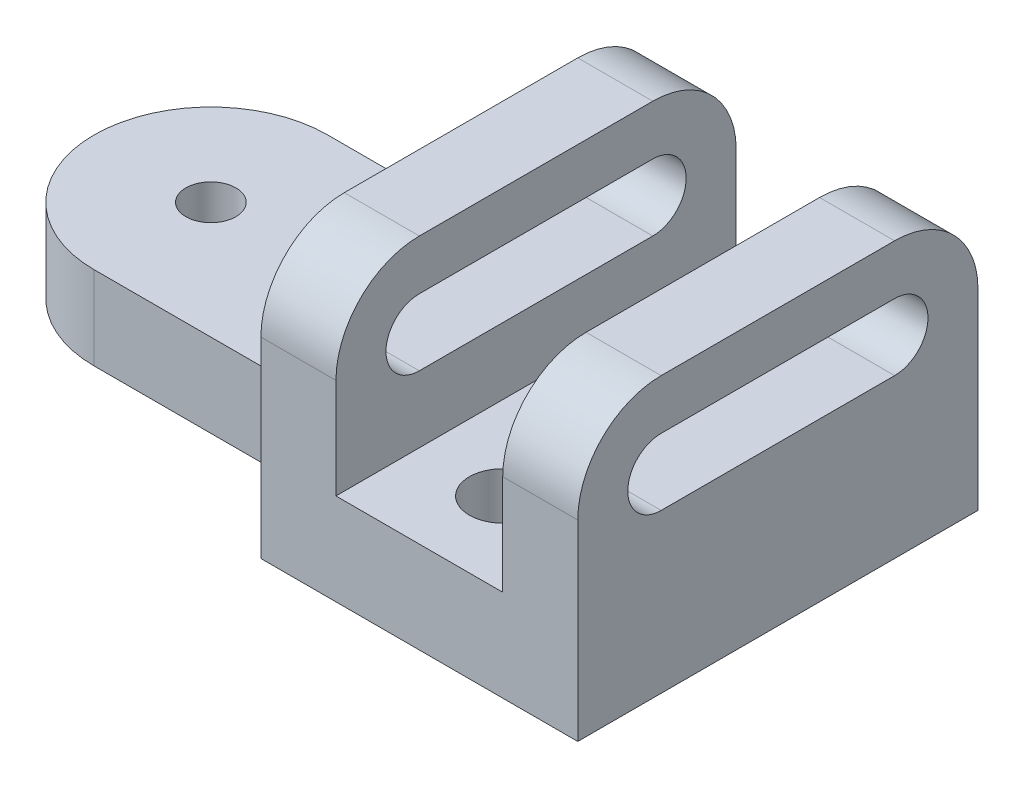
ISO-10303-21;
HEADER;
FILE_DESCRIPTION(('STEP AP214'),'2;1');
FILE_NAME('part.step','',(''),(''),'','','');
FILE_SCHEMA(('AUTOMOTIVE_DESIGN { 1 0 10303 214 1 1 1 1 }'));
ENDSEC;
DATA;
#1=APPLICATION_CONTEXT('core data for automotive mechanical design processes');
#2=APPLICATION_PROTOCOL_DEFINITION('international standard','automotive_design',2000,#1);
#3=PRODUCT_CONTEXT('',#1,'mechanical');
#4=PRODUCT('Part','Part','',(#3));
#5=PRODUCT_RELATED_PRODUCT_CATEGORY('part','',(#4));
#6=PRODUCT_DEFINITION_FORMATION('','',#4);
#7=PRODUCT_DEFINITION_CONTEXT('part definition',#1,'design');
#8=PRODUCT_DEFINITION('design','',#6,#7);
#9=PRODUCT_DEFINITION_SHAPE('','',#8);
#10=(LENGTH_UNIT() NAMED_UNIT(*) SI_UNIT(.MILLI.,.METRE.));
#11=(NAMED_UNIT(*) PLANE_ANGLE_UNIT() SI_UNIT($,.RADIAN.));
#12=(NAMED_UNIT(*) SI_UNIT($,.STERADIAN.) SOLID_ANGLE_UNIT());
#13=UNCERTAINTY_MEASURE_WITH_UNIT(LENGTH_MEASURE(1.E-05),#10,'distance_accuracy_value','');
#14=(GEOMETRIC_REPRESENTATION_CONTEXT(3) GLOBAL_UNCERTAINTY_ASSIGNED_CONTEXT((#13)) GLOBAL_UNIT_ASSIGNED_CONTEXT((#10,
#11,#12)) REPRESENTATION_CONTEXT('',''));
#15=CARTESIAN_POINT('',(0.,0.,0.));
#16=DIRECTION('',(0.,0.,1.));
#17=DIRECTION('',(1.,0.,0.));
#18=AXIS2_PLACEMENT_3D('',#15,#16,#17);
#19=CARTESIAN_POINT('',(0.,36.5125,60.325));
#20=DIRECTION('',(1.,0.,0.));
#21=DIRECTION('',(0.,0.,-1.));
#22=AXIS2_PLACEMENT_3D('',#19,#20,#21);
#23=PLANE('',#22);
#24=CARTESIAN_POINT('',(0.,36.5125,60.325));
#25=DIRECTION('',(1.,0.,0.));
#26=DIRECTION('',(0.,0.,-1.));
#27=AXIS2_PLACEMENT_3D('',#24,#25,#26);
#28=CIRCLE('',#27,6.35);
#29=CARTESIAN_POINT('',(0.,42.8625,60.325));
#30=VERTEX_POINT('',#29);
#31=CARTESIAN_POINT('',(0.,30.1625,60.325));
#32=VERTEX_POINT('',#31);
#33=EDGE_CURVE('E311',#30,#32,#28,.T.);
#34=ORIENTED_EDGE('',*,*,#33,.T.);
#35=DIRECTION('',(0.,0.,-1.));
#36=VECTOR('',#35,1.);
#37=CARTESIAN_POINT('',(0.,30.1625,60.325));
#38=LINE('',#37,#36);
#39=CARTESIAN_POINT('',(0.,30.1625,15.875));
#40=VERTEX_POINT('',#39);
#41=EDGE_CURVE('E325',#32,#40,#38,.T.);
#42=ORIENTED_EDGE('',*,*,#41,.T.);
#43=CARTESIAN_POINT('',(0.,36.5125,15.875));
#44=DIRECTION('',(1.,0.,0.));
#45=DIRECTION('',(0.,0.,1.));
#46=AXIS2_PLACEMENT_3D('',#43,#44,#45);
#47=CIRCLE('',#46,6.35);
#48=CARTESIAN_POINT('',(0.,42.8625,15.875));
#49=VERTEX_POINT('',#48);
#50=EDGE_CURVE('E328',#40,#49,#47,.T.);
#51=ORIENTED_EDGE('',*,*,#50,.T.);
#52=DIRECTION('',(0.,0.,1.));
#53=VECTOR('',#52,1.);
#54=CARTESIAN_POINT('',(0.,42.8625,60.325));
#55=LINE('',#54,#53);
#56=EDGE_CURVE('E315',#49,#30,#55,.T.);
#57=ORIENTED_EDGE('',*,*,#56,.T.);
#58=EDGE_LOOP('',(#34,#42,#51,#57));
#59=FACE_BOUND('',#58,.T.);
#60=DIRECTION('',(0.,0.,-1.));
#61=VECTOR('',#60,1.);
#62=CARTESIAN_POINT('',(0.,0.,76.2));
#63=LINE('',#62,#61);
#64=CARTESIAN_POINT('',(0.,0.,3.175));
#65=VERTEX_POINT('',#64);
#66=CARTESIAN_POINT('',(0.,0.,0.));
#67=VERTEX_POINT('',#66);
#68=EDGE_CURVE('E368',#65,#67,#63,.T.);
#69=ORIENTED_EDGE('',*,*,#68,.F.);
#70=DIRECTION('',(0.,-1.,0.));
#71=VECTOR('',#70,1.);
#72=CARTESIAN_POINT('',(0.,15.875,3.17499999999999));
#73=LINE('',#72,#71);
#74=CARTESIAN_POINT('',(0.,15.875,3.17499999999999));
#75=VERTEX_POINT('',#74);
#76=EDGE_CURVE('E390',#65,#75,#73,.F.);
#77=ORIENTED_EDGE('',*,*,#76,.T.);
#78=DIRECTION('',(0.,0.,-1.));
#79=VECTOR('',#78,1.);
#80=CARTESIAN_POINT('',(0.,15.875,0.));
#81=LINE('',#80,#79);
#82=CARTESIAN_POINT('',(0.,15.875,73.025));
#83=VERTEX_POINT('',#82);
#84=EDGE_CURVE('E227',#83,#75,#81,.T.);
#85=ORIENTED_EDGE('',*,*,#84,.F.);
#86=DIRECTION('',(0.,-1.,0.));
#87=VECTOR('',#86,1.);
#88=CARTESIAN_POINT('',(0.,36.5125,73.025));
#89=LINE('',#88,#87);
#90=CARTESIAN_POINT('',(0.,0.,73.025));
#91=VERTEX_POINT('',#90);
#92=EDGE_CURVE('E407',#83,#91,#89,.T.);
#93=ORIENTED_EDGE('',*,*,#92,.T.);
#94=CARTESIAN_POINT('',(0.,0.,76.2));
#95=VERTEX_POINT('',#94);
#96=EDGE_CURVE('E378',#95,#91,#63,.T.);
#97=ORIENTED_EDGE('',*,*,#96,.F.);
#98=DIRECTION('',(0.,-1.,0.));
#99=VECTOR('',#98,1.);
#100=CARTESIAN_POINT('',(0.,36.5125,76.2));
#101=LINE('',#100,#99);
#102=CARTESIAN_POINT('',(0.,36.5125,76.2));
#103=VERTEX_POINT('',#102);
#104=EDGE_CURVE('E366',#103,#95,#101,.T.);
#105=ORIENTED_EDGE('',*,*,#104,.F.);
#106=CARTESIAN_POINT('',(0.,36.5125,60.325));
#107=DIRECTION('',(1.,0.,0.));
#108=DIRECTION('',(0.,0.,-1.));
#109=AXIS2_PLACEMENT_3D('',#106,#107,#108);
#110=CIRCLE('',#109,15.875);
#111=CARTESIAN_POINT('',(0.,52.3875,60.325));
#112=VERTEX_POINT('',#111);
#113=EDGE_CURVE('E348',#112,#103,#110,.T.);
#114=ORIENTED_EDGE('',*,*,#113,.F.);
#115=DIRECTION('',(0.,0.,1.));
#116=VECTOR('',#115,1.);
#117=CARTESIAN_POINT('',(0.,52.3875,60.325));
#118=LINE('',#117,#116);
#119=CARTESIAN_POINT('',(0.,52.3875,15.875));
#120=VERTEX_POINT('',#119);
#121=EDGE_CURVE('E353',#120,#112,#118,.T.);
#122=ORIENTED_EDGE('',*,*,#121,.F.);
#123=CARTESIAN_POINT('',(0.,36.5125,15.875));
#124=DIRECTION('',(1.,0.,0.));
#125=DIRECTION('',(0.,0.,1.));
#126=AXIS2_PLACEMENT_3D('',#123,#124,#125);
#127=CIRCLE('',#126,15.875);
#128=CARTESIAN_POINT('',(0.,36.5125,0.));
#129=VERTEX_POINT('',#128);
#130=EDGE_CURVE('E441',#129,#120,#127,.T.);
#131=ORIENTED_EDGE('',*,*,#130,.F.);
#132=DIRECTION('',(0.,1.,0.));
#133=VECTOR('',#132,1.);
#134=CARTESIAN_POINT('',(0.,36.5125,0.));
#135=LINE('',#134,#133);
#136=EDGE_CURVE('E371',#67,#129,#135,.T.);
#137=ORIENTED_EDGE('',*,*,#136,.F.);
#138=EDGE_LOOP('',(#69,#77,#85,#93,#97,#105,#114,#122,#131,#137));
#139=FACE_BOUND('',#138,.T.);
#140=ADVANCED_FACE('F44',(#59,#139),#23,.F.);
#141=CARTESIAN_POINT('',(60.325,36.5125,60.325));
#142=DIRECTION('',(-1.,0.,0.));
#143=DIRECTION('',(0.,0.,1.));
#144=AXIS2_PLACEMENT_3D('',#141,#142,#143);
#145=CYLINDRICAL_SURFACE('',#144,15.875);
#146=DIRECTION('',(-1.,0.,0.));
#147=VECTOR('',#146,1.);
#148=CARTESIAN_POINT('',(60.325,36.5125,76.2));
#149=LINE('',#148,#147);
#150=CARTESIAN_POINT('',(14.2875,36.5125,76.2));
#151=VERTEX_POINT('',#150);
#152=EDGE_CURVE('E421',#151,#103,#149,.T.);
#153=ORIENTED_EDGE('',*,*,#152,.F.);
#154=CARTESIAN_POINT('',(14.2875,36.5125,60.325));
#155=DIRECTION('',(-1.,0.,0.));
#156=DIRECTION('',(0.,-1.,0.));
#157=AXIS2_PLACEMENT_3D('',#154,#155,#156);
#158=CIRCLE('',#157,15.875);
#159=CARTESIAN_POINT('',(14.2875,52.3875,60.325));
#160=VERTEX_POINT('',#159);
#161=EDGE_CURVE('E308',#151,#160,#158,.T.);
#162=ORIENTED_EDGE('',*,*,#161,.T.);
#163=DIRECTION('',(-1.,0.,0.));
#164=VECTOR('',#163,1.);
#165=CARTESIAN_POINT('',(60.325,52.3875,60.325));
#166=LINE('',#165,#164);
#167=EDGE_CURVE('E363',#160,#112,#166,.T.);
#168=ORIENTED_EDGE('',*,*,#167,.T.);
#169=ORIENTED_EDGE('',*,*,#113,.T.);
#170=EDGE_LOOP('',(#153,#162,#168,#169));
#171=FACE_BOUND('',#170,.T.);
#172=ADVANCED_FACE('F486',(#171),#145,.T.);
#173=CARTESIAN_POINT('',(60.325,36.5125,15.875));
#174=DIRECTION('',(-1.,0.,0.));
#175=DIRECTION('',(0.,0.,1.));
#176=AXIS2_PLACEMENT_3D('',#173,#174,#175);
#177=CYLINDRICAL_SURFACE('',#176,15.875);
#178=DIRECTION('',(-1.,0.,0.));
#179=VECTOR('',#178,1.);
#180=CARTESIAN_POINT('',(60.325,52.3875,15.875));
#181=LINE('',#180,#179);
#182=CARTESIAN_POINT('',(14.2875,52.3875,15.875));
#183=VERTEX_POINT('',#182);
#184=EDGE_CURVE('E436',#183,#120,#181,.T.);
#185=ORIENTED_EDGE('',*,*,#184,.F.);
#186=CARTESIAN_POINT('',(14.2875,36.5125,15.875));
#187=DIRECTION('',(-1.,0.,0.));
#188=DIRECTION('',(0.,-1.,0.));
#189=AXIS2_PLACEMENT_3D('',#186,#187,#188);
#190=CIRCLE('',#189,15.875);
#191=CARTESIAN_POINT('',(14.2875,36.5125,0.));
#192=VERTEX_POINT('',#191);
#193=EDGE_CURVE('E305',#183,#192,#190,.T.);
#194=ORIENTED_EDGE('',*,*,#193,.T.);
#195=DIRECTION('',(-1.,0.,0.));
#196=VECTOR('',#195,1.);
#197=CARTESIAN_POINT('',(60.325,36.5125,0.));
#198=LINE('',#197,#196);
#199=EDGE_CURVE('E432',#192,#129,#198,.T.);
#200=ORIENTED_EDGE('',*,*,#199,.T.);
#201=ORIENTED_EDGE('',*,*,#130,.T.);
#202=EDGE_LOOP('',(#185,#194,#200,#201));
#203=FACE_BOUND('',#202,.T.);
#204=ADVANCED_FACE('F456',(#203),#177,.T.);
#205=CARTESIAN_POINT('',(60.325,52.3875,60.325));
#206=DIRECTION('',(0.,-1.,0.));
#207=DIRECTION('',(0.,0.,-1.));
#208=AXIS2_PLACEMENT_3D('',#205,#206,#207);
#209=PLANE('',#208);
#210=ORIENTED_EDGE('',*,*,#167,.F.);
#211=DIRECTION('',(0.,0.,1.));
#212=VECTOR('',#211,1.);
#213=CARTESIAN_POINT('',(14.2875,52.3875,0.));
#214=LINE('',#213,#212);
#215=EDGE_CURVE('E278',#183,#160,#214,.T.);
#216=ORIENTED_EDGE('',*,*,#215,.F.);
#217=ORIENTED_EDGE('',*,*,#184,.T.);
#218=ORIENTED_EDGE('',*,*,#121,.T.);
#219=EDGE_LOOP('',(#210,#216,#217,#218));
#220=FACE_BOUND('',#219,.T.);
#221=ADVANCED_FACE('F454',(#220),#209,.F.);
#222=CARTESIAN_POINT('',(60.325,36.5125,60.325));
#223=DIRECTION('',(-1.,0.,0.));
#224=DIRECTION('',(0.,0.,1.));
#225=AXIS2_PLACEMENT_3D('',#222,#223,#224);
#226=CYLINDRICAL_SURFACE('',#225,6.35);
#227=CARTESIAN_POINT('',(14.2875,36.5125,60.325));
#228=DIRECTION('',(-1.,0.,0.));
#229=DIRECTION('',(0.,-1.,0.));
#230=AXIS2_PLACEMENT_3D('',#227,#228,#229);
#231=CIRCLE('',#230,6.35);
#232=CARTESIAN_POINT('',(14.2875,30.1625,60.325));
#233=VERTEX_POINT('',#232);
#234=CARTESIAN_POINT('',(14.2875,42.8625,60.325));
#235=VERTEX_POINT('',#234);
#236=EDGE_CURVE('E303',#233,#235,#231,.T.);
#237=ORIENTED_EDGE('',*,*,#236,.F.);
#238=DIRECTION('',(-1.,0.,0.));
#239=VECTOR('',#238,1.);
#240=CARTESIAN_POINT('',(60.325,30.1625,60.325));
#241=LINE('',#240,#239);
#242=EDGE_CURVE('E344',#233,#32,#241,.T.);
#243=ORIENTED_EDGE('',*,*,#242,.T.);
#244=ORIENTED_EDGE('',*,*,#33,.F.);
#245=DIRECTION('',(-1.,0.,0.));
#246=VECTOR('',#245,1.);
#247=CARTESIAN_POINT('',(60.325,42.8625,60.325));
#248=LINE('',#247,#246);
#249=EDGE_CURVE('E322',#235,#30,#248,.T.);
#250=ORIENTED_EDGE('',*,*,#249,.F.);
#251=EDGE_LOOP('',(#237,#243,#244,#250));
#252=FACE_BOUND('',#251,.T.);
#253=ADVANCED_FACE('F586',(#252),#226,.F.);
#254=CARTESIAN_POINT('',(60.325,30.1625,60.325));
#255=DIRECTION('',(0.,1.,0.));
#256=DIRECTION('',(0.,0.,1.));
#257=AXIS2_PLACEMENT_3D('',#254,#255,#256);
#258=PLANE('',#257);
#259=DIRECTION('',(0.,0.,1.));
#260=VECTOR('',#259,1.);
#261=CARTESIAN_POINT('',(14.2875,30.1625,60.325));
#262=LINE('',#261,#260);
#263=CARTESIAN_POINT('',(14.2875,30.1625,15.875));
#264=VERTEX_POINT('',#263);
#265=EDGE_CURVE('E301',#264,#233,#262,.T.);
#266=ORIENTED_EDGE('',*,*,#265,.F.);
#267=DIRECTION('',(-1.,0.,0.));
#268=VECTOR('',#267,1.);
#269=CARTESIAN_POINT('',(60.325,30.1625,15.875));
#270=LINE('',#269,#268);
#271=EDGE_CURVE('E340',#264,#40,#270,.T.);
#272=ORIENTED_EDGE('',*,*,#271,.T.);
#273=ORIENTED_EDGE('',*,*,#41,.F.);
#274=ORIENTED_EDGE('',*,*,#242,.F.);
#275=EDGE_LOOP('',(#266,#272,#273,#274));
#276=FACE_BOUND('',#275,.T.);
#277=ADVANCED_FACE('F583',(#276),#258,.T.);
#278=CARTESIAN_POINT('',(60.325,36.5125,15.875));
#279=DIRECTION('',(-1.,0.,0.));
#280=DIRECTION('',(0.,0.,1.));
#281=AXIS2_PLACEMENT_3D('',#278,#279,#280);
#282=CYLINDRICAL_SURFACE('',#281,6.35);
#283=CARTESIAN_POINT('',(14.2875,36.5125,15.875));
#284=DIRECTION('',(-1.,0.,0.));
#285=DIRECTION('',(0.,-1.,0.));
#286=AXIS2_PLACEMENT_3D('',#283,#284,#285);
#287=CIRCLE('',#286,6.35);
#288=CARTESIAN_POINT('',(14.2875,42.8625,15.875));
#289=VERTEX_POINT('',#288);
#290=EDGE_CURVE('E299',#289,#264,#287,.T.);
#291=ORIENTED_EDGE('',*,*,#290,.F.);
#292=DIRECTION('',(-1.,0.,0.));
#293=VECTOR('',#292,1.);
#294=CARTESIAN_POINT('',(60.325,42.8625,15.875));
#295=LINE('',#294,#293);
#296=EDGE_CURVE('E336',#289,#49,#295,.T.);
#297=ORIENTED_EDGE('',*,*,#296,.T.);
#298=ORIENTED_EDGE('',*,*,#50,.F.);
#299=ORIENTED_EDGE('',*,*,#271,.F.);
#300=EDGE_LOOP('',(#291,#297,#298,#299));
#301=FACE_BOUND('',#300,.T.);
#302=ADVANCED_FACE('F580',(#301),#282,.F.);
#303=CARTESIAN_POINT('',(60.325,42.8625,60.325));
#304=DIRECTION('',(0.,-1.,0.));
#305=DIRECTION('',(0.,0.,-1.));
#306=AXIS2_PLACEMENT_3D('',#303,#304,#305);
#307=PLANE('',#306);
#308=DIRECTION('',(0.,0.,-1.));
#309=VECTOR('',#308,1.);
#310=CARTESIAN_POINT('',(14.2875,42.8625,60.325));
#311=LINE('',#310,#309);
#312=EDGE_CURVE('E381',#235,#289,#311,.T.);
#313=ORIENTED_EDGE('',*,*,#312,.F.);
#314=ORIENTED_EDGE('',*,*,#249,.T.);
#315=ORIENTED_EDGE('',*,*,#56,.F.);
#316=ORIENTED_EDGE('',*,*,#296,.F.);
#317=EDGE_LOOP('',(#313,#314,#315,#316));
#318=FACE_BOUND('',#317,.T.);
#319=ADVANCED_FACE('F498',(#318),#307,.T.);
#320=CARTESIAN_POINT('',(60.325,36.5125,60.325));
#321=DIRECTION('',(1.,0.,0.));
#322=DIRECTION('',(0.,0.,-1.));
#323=AXIS2_PLACEMENT_3D('',#320,#321,#322);
#324=PLANE('',#323);
#325=CARTESIAN_POINT('',(60.325,36.5125,60.325));
#326=DIRECTION('',(1.,0.,0.));
#327=DIRECTION('',(0.,0.,-1.));
#328=AXIS2_PLACEMENT_3D('',#325,#326,#327);
#329=CIRCLE('',#328,15.875);
#330=CARTESIAN_POINT('',(60.325,52.3875,60.325));
#331=VERTEX_POINT('',#330);
#332=CARTESIAN_POINT('',(60.325,36.5125,76.2));
#333=VERTEX_POINT('',#332);
#334=EDGE_CURVE('E349',#331,#333,#329,.T.);
#335=ORIENTED_EDGE('',*,*,#334,.T.);
#336=DIRECTION('',(0.,-1.,0.));
#337=VECTOR('',#336,1.);
#338=CARTESIAN_POINT('',(60.325,36.5125,76.2));
#339=LINE('',#338,#337);
#340=CARTESIAN_POINT('',(60.325,0.,76.2));
#341=VERTEX_POINT('',#340);
#342=EDGE_CURVE('E352',#333,#341,#339,.T.);
#343=ORIENTED_EDGE('',*,*,#342,.T.);
#344=DIRECTION('',(0.,0.,-1.));
#345=VECTOR('',#344,1.);
#346=CARTESIAN_POINT('',(60.325,0.,76.2));
#347=LINE('',#346,#345);
#348=CARTESIAN_POINT('',(60.325,0.,0.));
#349=VERTEX_POINT('',#348);
#350=EDGE_CURVE('E355',#341,#349,#347,.T.);
#351=ORIENTED_EDGE('',*,*,#350,.T.);
#352=DIRECTION('',(0.,1.,0.));
#353=VECTOR('',#352,1.);
#354=CARTESIAN_POINT('',(60.325,36.5125,0.));
#355=LINE('',#354,#353);
#356=CARTESIAN_POINT('',(60.325,36.5125,0.));
#357=VERTEX_POINT('',#356);
#358=EDGE_CURVE('E357',#349,#357,#355,.T.);
#359=ORIENTED_EDGE('',*,*,#358,.T.);
#360=CARTESIAN_POINT('',(60.325,36.5125,15.875));
#361=DIRECTION('',(1.,0.,0.));
#362=DIRECTION('',(0.,0.,1.));
#363=AXIS2_PLACEMENT_3D('',#360,#361,#362);
#364=CIRCLE('',#363,15.875);
#365=CARTESIAN_POINT('',(60.325,52.3875,15.875));
#366=VERTEX_POINT('',#365);
#367=EDGE_CURVE('E359',#357,#366,#364,.T.);
#368=ORIENTED_EDGE('',*,*,#367,.T.);
#369=DIRECTION('',(0.,0.,1.));
#370=VECTOR('',#369,1.);
#371=CARTESIAN_POINT('',(60.325,52.3875,60.325));
#372=LINE('',#371,#370);
#373=EDGE_CURVE('E361',#366,#331,#372,.T.);
#374=ORIENTED_EDGE('',*,*,#373,.T.);
#375=EDGE_LOOP('',(#335,#343,#351,#359,#368,#374));
#376=FACE_BOUND('',#375,.T.);
#377=DIRECTION('',(0.,0.,-1.));
#378=VECTOR('',#377,1.);
#379=CARTESIAN_POINT('',(60.325,30.1625,60.325));
#380=LINE('',#379,#378);
#381=CARTESIAN_POINT('',(60.325,30.1625,60.325));
#382=VERTEX_POINT('',#381);
#383=CARTESIAN_POINT('',(60.325,30.1625,15.875));
#384=VERTEX_POINT('',#383);
#385=EDGE_CURVE('E314',#382,#384,#380,.T.);
#386=ORIENTED_EDGE('',*,*,#385,.F.);
#387=CARTESIAN_POINT('',(60.325,36.5125,60.325));
#388=DIRECTION('',(1.,0.,0.));
#389=DIRECTION('',(0.,0.,-1.));
#390=AXIS2_PLACEMENT_3D('',#387,#388,#389);
#391=CIRCLE('',#390,6.35);
#392=CARTESIAN_POINT('',(60.325,42.8625,60.325));
#393=VERTEX_POINT('',#392);
#394=EDGE_CURVE('E312',#393,#382,#391,.T.);
#395=ORIENTED_EDGE('',*,*,#394,.F.);
#396=DIRECTION('',(0.,0.,1.));
#397=VECTOR('',#396,1.);
#398=CARTESIAN_POINT('',(60.325,42.8625,60.325));
#399=LINE('',#398,#397);
#400=CARTESIAN_POINT('',(60.325,42.8625,15.875));
#401=VERTEX_POINT('',#400);
#402=EDGE_CURVE('E320',#401,#393,#399,.T.);
#403=ORIENTED_EDGE('',*,*,#402,.F.);
#404=CARTESIAN_POINT('',(60.325,36.5125,15.875));
#405=DIRECTION('',(1.,0.,0.));
#406=DIRECTION('',(0.,0.,1.));
#407=AXIS2_PLACEMENT_3D('',#404,#405,#406);
#408=CIRCLE('',#407,6.35);
#409=EDGE_CURVE('E317',#384,#401,#408,.T.);
#410=ORIENTED_EDGE('',*,*,#409,.F.);
#411=EDGE_LOOP('',(#386,#395,#403,#410));
#412=FACE_BOUND('',#411,.T.);
#413=ADVANCED_FACE('F478',(#376,#412),#324,.T.);
#414=CARTESIAN_POINT('',(46.0375,52.3875,60.325));
#415=VERTEX_POINT('',#414);
#416=EDGE_CURVE('E437',#331,#415,#166,.T.);
#417=ORIENTED_EDGE('',*,*,#416,.T.);
#418=CARTESIAN_POINT('',(46.0375,36.5125,60.325));
#419=DIRECTION('',(1.,0.,0.));
#420=DIRECTION('',(0.,1.,0.));
#421=AXIS2_PLACEMENT_3D('',#418,#419,#420);
#422=CIRCLE('',#421,15.875);
#423=CARTESIAN_POINT('',(46.0375,36.5125,76.2));
#424=VERTEX_POINT('',#423);
#425=EDGE_CURVE('E296',#415,#424,#422,.T.);
#426=ORIENTED_EDGE('',*,*,#425,.T.);
#427=EDGE_CURVE('E416',#333,#424,#149,.T.);
#428=ORIENTED_EDGE('',*,*,#427,.F.);
#429=ORIENTED_EDGE('',*,*,#334,.F.);
#430=EDGE_LOOP('',(#417,#426,#428,#429));
#431=FACE_BOUND('',#430,.T.);
#432=ADVANCED_FACE('F490',(#431),#145,.T.);
#433=CARTESIAN_POINT('',(60.325,36.5125,76.2));
#434=DIRECTION('',(0.,0.,-1.));
#435=DIRECTION('',(-1.,0.,0.));
#436=AXIS2_PLACEMENT_3D('',#433,#434,#435);
#437=PLANE('',#436);
#438=DIRECTION('',(1.,0.,0.));
#439=VECTOR('',#438,1.);
#440=CARTESIAN_POINT('',(14.2875,17.4625,76.2));
#441=LINE('',#440,#439);
#442=CARTESIAN_POINT('',(14.2875,17.4625,76.2));
#443=VERTEX_POINT('',#442);
#444=CARTESIAN_POINT('',(46.0375,17.4625,76.2));
#445=VERTEX_POINT('',#444);
#446=EDGE_CURVE('E274',#443,#445,#441,.T.);
#447=ORIENTED_EDGE('',*,*,#446,.F.);
#448=DIRECTION('',(0.,-1.,0.));
#449=VECTOR('',#448,1.);
#450=CARTESIAN_POINT('',(14.2875,52.3875,76.2));
#451=LINE('',#450,#449);
#452=EDGE_CURVE('E260',#151,#443,#451,.T.);
#453=ORIENTED_EDGE('',*,*,#452,.F.);
#454=ORIENTED_EDGE('',*,*,#152,.T.);
#455=ORIENTED_EDGE('',*,*,#104,.T.);
#456=DIRECTION('',(-1.,0.,0.));
#457=VECTOR('',#456,1.);
#458=CARTESIAN_POINT('',(60.325,0.,76.2));
#459=LINE('',#458,#457);
#460=EDGE_CURVE('E424',#341,#95,#459,.T.);
#461=ORIENTED_EDGE('',*,*,#460,.F.);
#462=ORIENTED_EDGE('',*,*,#342,.F.);
#463=ORIENTED_EDGE('',*,*,#427,.T.);
#464=DIRECTION('',(0.,1.,0.));
#465=VECTOR('',#464,1.);
#466=CARTESIAN_POINT('',(46.0375,52.3875,76.2));
#467=LINE('',#466,#465);
#468=EDGE_CURVE('E266',#445,#424,#467,.T.);
#469=ORIENTED_EDGE('',*,*,#468,.F.);
#470=EDGE_LOOP('',(#447,#453,#454,#455,#461,#462,#463,#469));
#471=FACE_BOUND('',#470,.T.);
#472=ADVANCED_FACE('F488',(#471),#437,.F.);
#473=CARTESIAN_POINT('',(60.325,0.,76.2));
#474=DIRECTION('',(0.,1.,0.));
#475=DIRECTION('',(0.,0.,1.));
#476=AXIS2_PLACEMENT_3D('',#473,#474,#475);
#477=PLANE('',#476);
#478=CARTESIAN_POINT('',(30.1625,0.,15.875));
#479=DIRECTION('',(0.,1.,0.));
#480=DIRECTION('',(-1.,0.,0.));
#481=AXIS2_PLACEMENT_3D('',#478,#479,#480);
#482=CIRCLE('',#481,6.35);
#483=CARTESIAN_POINT('',(23.8125,0.,15.875));
#484=VERTEX_POINT('',#483);
#485=EDGE_CURVE('E526',#484,#484,#482,.T.);
#486=ORIENTED_EDGE('',*,*,#485,.T.);
#487=EDGE_LOOP('',(#486));
#488=FACE_BOUND('',#487,.T.);
#489=CARTESIAN_POINT('',(30.1625,0.,60.325));
#490=DIRECTION('',(0.,1.,0.));
#491=DIRECTION('',(-1.,0.,0.));
#492=AXIS2_PLACEMENT_3D('',#489,#490,#491);
#493=CIRCLE('',#492,6.35);
#494=CARTESIAN_POINT('',(23.8125,0.,60.325));
#495=VERTEX_POINT('',#494);
#496=EDGE_CURVE('E258',#495,#495,#493,.T.);
#497=ORIENTED_EDGE('',*,*,#496,.T.);
#498=EDGE_LOOP('',(#497));
#499=FACE_BOUND('',#498,.T.);
#500=ORIENTED_EDGE('',*,*,#96,.T.);
#501=CARTESIAN_POINT('',(-12.7,0.,73.025));
#502=DIRECTION('',(0.,1.,0.));
#503=DIRECTION('',(0.,0.,1.));
#504=AXIS2_PLACEMENT_3D('',#501,#502,#503);
#505=CIRCLE('',#504,12.7);
#506=CARTESIAN_POINT('',(-12.7,0.,60.325));
#507=VERTEX_POINT('',#506);
#508=EDGE_CURVE('E52',#91,#507,#505,.T.);
#509=ORIENTED_EDGE('',*,*,#508,.T.);
#510=DIRECTION('',(-1.,0.,0.));
#511=VECTOR('',#510,1.);
#512=CARTESIAN_POINT('',(0.,0.,60.325));
#513=LINE('',#512,#511);
#514=CARTESIAN_POINT('',(-47.625,0.,60.325));
#515=VERTEX_POINT('',#514);
#516=EDGE_CURVE('E246',#507,#515,#513,.T.);
#517=ORIENTED_EDGE('',*,*,#516,.T.);
#518=CARTESIAN_POINT('',(-47.625,0.,38.1));
#519=DIRECTION('',(0.,-1.,0.));
#520=DIRECTION('',(0.,0.,-1.));
#521=AXIS2_PLACEMENT_3D('',#518,#519,#520);
#522=CIRCLE('',#521,22.225);
#523=CARTESIAN_POINT('',(-47.625,0.,15.875));
#524=VERTEX_POINT('',#523);
#525=EDGE_CURVE('E257',#515,#524,#522,.T.);
#526=ORIENTED_EDGE('',*,*,#525,.T.);
#527=DIRECTION('',(-1.,0.,0.));
#528=VECTOR('',#527,1.);
#529=CARTESIAN_POINT('',(0.,0.,15.875));
#530=LINE('',#529,#528);
#531=CARTESIAN_POINT('',(-12.7,0.,15.875));
#532=VERTEX_POINT('',#531);
#533=EDGE_CURVE('E233',#532,#524,#530,.T.);
#534=ORIENTED_EDGE('',*,*,#533,.F.);
#535=CARTESIAN_POINT('',(-12.7,0.,3.17499999999999));
#536=DIRECTION('',(0.,1.,0.));
#537=DIRECTION('',(0.,0.,1.));
#538=AXIS2_PLACEMENT_3D('',#535,#536,#537);
#539=CIRCLE('',#538,12.7);
#540=EDGE_CURVE('E392',#532,#65,#539,.T.);
#541=ORIENTED_EDGE('',*,*,#540,.T.);
#542=ORIENTED_EDGE('',*,*,#68,.T.);
#543=DIRECTION('',(-1.,0.,0.));
#544=VECTOR('',#543,1.);
#545=CARTESIAN_POINT('',(60.325,0.,0.));
#546=LINE('',#545,#544);
#547=EDGE_CURVE('E427',#349,#67,#546,.T.);
#548=ORIENTED_EDGE('',*,*,#547,.F.);
#549=ORIENTED_EDGE('',*,*,#350,.F.);
#550=ORIENTED_EDGE('',*,*,#460,.T.);
#551=EDGE_LOOP('',(#500,#509,#517,#526,#534,#541,#542,#548,#549,#550));
#552=FACE_BOUND('',#551,.T.);
#553=CARTESIAN_POINT('',(-47.625,0.,38.1));
#554=DIRECTION('',(0.,-1.,0.));
#555=DIRECTION('',(0.,0.,-1.));
#556=AXIS2_PLACEMENT_3D('',#553,#554,#555);
#557=CIRCLE('',#556,4.7625);
#558=CARTESIAN_POINT('',(-47.625,0.,33.3375));
#559=VERTEX_POINT('',#558);
#560=EDGE_CURVE('E243',#559,#559,#557,.T.);
#561=ORIENTED_EDGE('',*,*,#560,.F.);
#562=EDGE_LOOP('',(#561));
#563=FACE_BOUND('',#562,.T.);
#564=ADVANCED_FACE('F395',(#488,#499,#552,#563),#477,.F.);
#565=CARTESIAN_POINT('',(60.325,36.5125,0.));
#566=DIRECTION('',(0.,0.,1.));
#567=DIRECTION('',(1.,0.,0.));
#568=AXIS2_PLACEMENT_3D('',#565,#566,#567);
#569=PLANE('',#568);
#570=ORIENTED_EDGE('',*,*,#199,.F.);
#571=DIRECTION('',(0.,-1.,0.));
#572=VECTOR('',#571,1.);
#573=CARTESIAN_POINT('',(14.2875,52.3875,0.));
#574=LINE('',#573,#572);
#575=CARTESIAN_POINT('',(14.2875,17.4625,0.));
#576=VERTEX_POINT('',#575);
#577=EDGE_CURVE('E262',#192,#576,#574,.T.);
#578=ORIENTED_EDGE('',*,*,#577,.T.);
#579=DIRECTION('',(1.,0.,0.));
#580=VECTOR('',#579,1.);
#581=CARTESIAN_POINT('',(14.2875,17.4625,0.));
#582=LINE('',#581,#580);
#583=CARTESIAN_POINT('',(46.0375,17.4625,0.));
#584=VERTEX_POINT('',#583);
#585=EDGE_CURVE('E265',#576,#584,#582,.T.);
#586=ORIENTED_EDGE('',*,*,#585,.T.);
#587=DIRECTION('',(0.,1.,0.));
#588=VECTOR('',#587,1.);
#589=CARTESIAN_POINT('',(46.0375,52.3875,0.));
#590=LINE('',#589,#588);
#591=CARTESIAN_POINT('',(46.0375,36.5125,0.));
#592=VERTEX_POINT('',#591);
#593=EDGE_CURVE('E269',#584,#592,#590,.T.);
#594=ORIENTED_EDGE('',*,*,#593,.T.);
#595=EDGE_CURVE('E429',#357,#592,#198,.T.);
#596=ORIENTED_EDGE('',*,*,#595,.F.);
#597=ORIENTED_EDGE('',*,*,#358,.F.);
#598=ORIENTED_EDGE('',*,*,#547,.T.);
#599=ORIENTED_EDGE('',*,*,#136,.T.);
#600=EDGE_LOOP('',(#570,#578,#586,#594,#596,#597,#598,#599));
#601=FACE_BOUND('',#600,.T.);
#602=ADVANCED_FACE('F448',(#601),#569,.F.);
#603=ORIENTED_EDGE('',*,*,#595,.T.);
#604=CARTESIAN_POINT('',(46.0375,36.5125,15.875));
#605=DIRECTION('',(1.,0.,0.));
#606=DIRECTION('',(0.,1.,0.));
#607=AXIS2_PLACEMENT_3D('',#604,#605,#606);
#608=CIRCLE('',#607,15.875);
#609=CARTESIAN_POINT('',(46.0375,52.3875,15.875));
#610=VERTEX_POINT('',#609);
#611=EDGE_CURVE('E293',#592,#610,#608,.T.);
#612=ORIENTED_EDGE('',*,*,#611,.T.);
#613=EDGE_CURVE('E433',#366,#610,#181,.T.);
#614=ORIENTED_EDGE('',*,*,#613,.F.);
#615=ORIENTED_EDGE('',*,*,#367,.F.);
#616=EDGE_LOOP('',(#603,#612,#614,#615));
#617=FACE_BOUND('',#616,.T.);
#618=ADVANCED_FACE('F470',(#617),#177,.T.);
#619=ORIENTED_EDGE('',*,*,#613,.T.);
#620=DIRECTION('',(0.,0.,1.));
#621=VECTOR('',#620,1.);
#622=CARTESIAN_POINT('',(46.0375,52.3875,0.));
#623=LINE('',#622,#621);
#624=EDGE_CURVE('E281',#610,#415,#623,.T.);
#625=ORIENTED_EDGE('',*,*,#624,.T.);
#626=ORIENTED_EDGE('',*,*,#416,.F.);
#627=ORIENTED_EDGE('',*,*,#373,.F.);
#628=EDGE_LOOP('',(#619,#625,#626,#627));
#629=FACE_BOUND('',#628,.T.);
#630=ADVANCED_FACE('F474',(#629),#209,.F.);
#631=CARTESIAN_POINT('',(46.0375,36.5125,60.325));
#632=DIRECTION('',(1.,0.,0.));
#633=DIRECTION('',(0.,1.,0.));
#634=AXIS2_PLACEMENT_3D('',#631,#632,#633);
#635=CIRCLE('',#634,6.35);
#636=CARTESIAN_POINT('',(46.0375,42.8625,60.325));
#637=VERTEX_POINT('',#636);
#638=CARTESIAN_POINT('',(46.0375,30.1625,60.325));
#639=VERTEX_POINT('',#638);
#640=EDGE_CURVE('E291',#637,#639,#635,.T.);
#641=ORIENTED_EDGE('',*,*,#640,.F.);
#642=EDGE_CURVE('E333',#393,#637,#248,.T.);
#643=ORIENTED_EDGE('',*,*,#642,.F.);
#644=ORIENTED_EDGE('',*,*,#394,.T.);
#645=EDGE_CURVE('E345',#382,#639,#241,.T.);
#646=ORIENTED_EDGE('',*,*,#645,.T.);
#647=EDGE_LOOP('',(#641,#643,#644,#646));
#648=FACE_BOUND('',#647,.T.);
#649=ADVANCED_FACE('F512',(#648),#226,.F.);
#650=DIRECTION('',(0.,0.,-1.));
#651=VECTOR('',#650,1.);
#652=CARTESIAN_POINT('',(46.0375,30.1625,60.325));
#653=LINE('',#652,#651);
#654=CARTESIAN_POINT('',(46.0375,30.1625,15.875));
#655=VERTEX_POINT('',#654);
#656=EDGE_CURVE('E289',#639,#655,#653,.T.);
#657=ORIENTED_EDGE('',*,*,#656,.F.);
#658=ORIENTED_EDGE('',*,*,#645,.F.);
#659=ORIENTED_EDGE('',*,*,#385,.T.);
#660=EDGE_CURVE('E341',#384,#655,#270,.T.);
#661=ORIENTED_EDGE('',*,*,#660,.T.);
#662=EDGE_LOOP('',(#657,#658,#659,#661));
#663=FACE_BOUND('',#662,.T.);
#664=ADVANCED_FACE('F578',(#663),#258,.T.);
#665=CARTESIAN_POINT('',(46.0375,36.5125,15.875));
#666=DIRECTION('',(1.,0.,0.));
#667=DIRECTION('',(0.,1.,0.));
#668=AXIS2_PLACEMENT_3D('',#665,#666,#667);
#669=CIRCLE('',#668,6.35);
#670=CARTESIAN_POINT('',(46.0375,42.8625,15.875));
#671=VERTEX_POINT('',#670);
#672=EDGE_CURVE('E280',#655,#671,#669,.T.);
#673=ORIENTED_EDGE('',*,*,#672,.F.);
#674=ORIENTED_EDGE('',*,*,#660,.F.);
#675=ORIENTED_EDGE('',*,*,#409,.T.);
#676=EDGE_CURVE('E337',#401,#671,#295,.T.);
#677=ORIENTED_EDGE('',*,*,#676,.T.);
#678=EDGE_LOOP('',(#673,#674,#675,#677));
#679=FACE_BOUND('',#678,.T.);
#680=ADVANCED_FACE('F574',(#679),#282,.F.);
#681=DIRECTION('',(0.,0.,1.));
#682=VECTOR('',#681,1.);
#683=CARTESIAN_POINT('',(46.0375,42.8625,60.325));
#684=LINE('',#683,#682);
#685=EDGE_CURVE('E412',#671,#637,#684,.T.);
#686=ORIENTED_EDGE('',*,*,#685,.F.);
#687=ORIENTED_EDGE('',*,*,#676,.F.);
#688=ORIENTED_EDGE('',*,*,#402,.T.);
#689=ORIENTED_EDGE('',*,*,#642,.T.);
#690=EDGE_LOOP('',(#686,#687,#688,#689));
#691=FACE_BOUND('',#690,.T.);
#692=ADVANCED_FACE('F571',(#691),#307,.T.);
#693=CARTESIAN_POINT('',(14.2875,52.3875,0.));
#694=DIRECTION('',(-1.,0.,0.));
#695=DIRECTION('',(0.,-1.,0.));
#696=AXIS2_PLACEMENT_3D('',#693,#694,#695);
#697=PLANE('',#696);
#698=ORIENTED_EDGE('',*,*,#236,.T.);
#699=ORIENTED_EDGE('',*,*,#312,.T.);
#700=ORIENTED_EDGE('',*,*,#290,.T.);
#701=ORIENTED_EDGE('',*,*,#265,.T.);
#702=EDGE_LOOP('',(#698,#699,#700,#701));
#703=FACE_BOUND('',#702,.T.);
#704=ORIENTED_EDGE('',*,*,#452,.T.);
#705=DIRECTION('',(0.,0.,1.));
#706=VECTOR('',#705,1.);
#707=CARTESIAN_POINT('',(14.2875,17.4625,0.));
#708=LINE('',#707,#706);
#709=EDGE_CURVE('E272',#576,#443,#708,.T.);
#710=ORIENTED_EDGE('',*,*,#709,.F.);
#711=ORIENTED_EDGE('',*,*,#577,.F.);
#712=ORIENTED_EDGE('',*,*,#193,.F.);
#713=ORIENTED_EDGE('',*,*,#215,.T.);
#714=ORIENTED_EDGE('',*,*,#161,.F.);
#715=EDGE_LOOP('',(#704,#710,#711,#712,#713,#714));
#716=FACE_BOUND('',#715,.T.);
#717=ADVANCED_FACE('F458',(#703,#716),#697,.F.);
#718=CARTESIAN_POINT('',(46.0375,52.3875,0.));
#719=DIRECTION('',(1.,0.,0.));
#720=DIRECTION('',(0.,1.,0.));
#721=AXIS2_PLACEMENT_3D('',#718,#719,#720);
#722=PLANE('',#721);
#723=ORIENTED_EDGE('',*,*,#640,.T.);
#724=ORIENTED_EDGE('',*,*,#656,.T.);
#725=ORIENTED_EDGE('',*,*,#672,.T.);
#726=ORIENTED_EDGE('',*,*,#685,.T.);
#727=EDGE_LOOP('',(#723,#724,#725,#726));
#728=FACE_BOUND('',#727,.T.);
#729=ORIENTED_EDGE('',*,*,#624,.F.);
#730=ORIENTED_EDGE('',*,*,#611,.F.);
#731=ORIENTED_EDGE('',*,*,#593,.F.);
#732=DIRECTION('',(0.,0.,1.));
#733=VECTOR('',#732,1.);
#734=CARTESIAN_POINT('',(46.0375,17.4625,0.));
#735=LINE('',#734,#733);
#736=EDGE_CURVE('E284',#584,#445,#735,.T.);
#737=ORIENTED_EDGE('',*,*,#736,.T.);
#738=ORIENTED_EDGE('',*,*,#468,.T.);
#739=ORIENTED_EDGE('',*,*,#425,.F.);
#740=EDGE_LOOP('',(#729,#730,#731,#737,#738,#739));
#741=FACE_BOUND('',#740,.T.);
#742=ADVANCED_FACE('F467',(#728,#741),#722,.F.);
#743=CARTESIAN_POINT('',(14.2875,17.4625,0.));
#744=DIRECTION('',(0.,-1.,0.));
#745=DIRECTION('',(1.,0.,0.));
#746=AXIS2_PLACEMENT_3D('',#743,#744,#745);
#747=PLANE('',#746);
#748=CARTESIAN_POINT('',(30.1625,17.4625,15.875));
#749=DIRECTION('',(0.,1.,0.));
#750=DIRECTION('',(-1.,0.,0.));
#751=AXIS2_PLACEMENT_3D('',#748,#749,#750);
#752=CIRCLE('',#751,6.35);
#753=CARTESIAN_POINT('',(23.8125,17.4625,15.875));
#754=VERTEX_POINT('',#753);
#755=EDGE_CURVE('E531',#754,#754,#752,.T.);
#756=ORIENTED_EDGE('',*,*,#755,.F.);
#757=EDGE_LOOP('',(#756));
#758=FACE_BOUND('',#757,.T.);
#759=CARTESIAN_POINT('',(30.1625,17.4625,60.325));
#760=DIRECTION('',(0.,1.,0.));
#761=DIRECTION('',(-1.,0.,0.));
#762=AXIS2_PLACEMENT_3D('',#759,#760,#761);
#763=CIRCLE('',#762,6.35);
#764=CARTESIAN_POINT('',(23.8125,17.4625,60.325));
#765=VERTEX_POINT('',#764);
#766=EDGE_CURVE('E249',#765,#765,#763,.T.);
#767=ORIENTED_EDGE('',*,*,#766,.F.);
#768=EDGE_LOOP('',(#767));
#769=FACE_BOUND('',#768,.T.);
#770=ORIENTED_EDGE('',*,*,#446,.T.);
#771=ORIENTED_EDGE('',*,*,#736,.F.);
#772=ORIENTED_EDGE('',*,*,#585,.F.);
#773=ORIENTED_EDGE('',*,*,#709,.T.);
#774=EDGE_LOOP('',(#770,#771,#772,#773));
#775=FACE_BOUND('',#774,.T.);
#776=ADVANCED_FACE('F463',(#758,#769,#775),#747,.F.);
#777=CARTESIAN_POINT('',(-47.625,15.875,38.1));
#778=DIRECTION('',(0.,-1.,0.));
#779=DIRECTION('',(0.,0.,-1.));
#780=AXIS2_PLACEMENT_3D('',#777,#778,#779);
#781=CYLINDRICAL_SURFACE('',#780,22.225);
#782=ORIENTED_EDGE('',*,*,#525,.F.);
#783=DIRECTION('',(0.,-1.,0.));
#784=VECTOR('',#783,1.);
#785=CARTESIAN_POINT('',(-47.625,15.875,60.325));
#786=LINE('',#785,#784);
#787=CARTESIAN_POINT('',(-47.625,15.875,60.325));
#788=VERTEX_POINT('',#787);
#789=EDGE_CURVE('E237',#788,#515,#786,.T.);
#790=ORIENTED_EDGE('',*,*,#789,.F.);
#791=CARTESIAN_POINT('',(-47.625,15.875,38.1));
#792=DIRECTION('',(0.,-1.,0.));
#793=DIRECTION('',(0.,0.,-1.));
#794=AXIS2_PLACEMENT_3D('',#791,#792,#793);
#795=CIRCLE('',#794,22.225);
#796=CARTESIAN_POINT('',(-47.625,15.875,15.875));
#797=VERTEX_POINT('',#796);
#798=EDGE_CURVE('E221',#788,#797,#795,.T.);
#799=ORIENTED_EDGE('',*,*,#798,.T.);
#800=DIRECTION('',(0.,-1.,0.));
#801=VECTOR('',#800,1.);
#802=CARTESIAN_POINT('',(-47.625,15.875,15.875));
#803=LINE('',#802,#801);
#804=EDGE_CURVE('E230',#797,#524,#803,.T.);
#805=ORIENTED_EDGE('',*,*,#804,.T.);
#806=EDGE_LOOP('',(#782,#790,#799,#805));
#807=FACE_BOUND('',#806,.T.);
#808=ADVANCED_FACE('F241',(#807),#781,.T.);
#809=CARTESIAN_POINT('',(0.,15.875,60.325));
#810=DIRECTION('',(0.,0.,1.));
#811=DIRECTION('',(1.,0.,0.));
#812=AXIS2_PLACEMENT_3D('',#809,#810,#811);
#813=PLANE('',#812);
#814=ORIENTED_EDGE('',*,*,#516,.F.);
#815=DIRECTION('',(0.,-1.,0.));
#816=VECTOR('',#815,1.);
#817=CARTESIAN_POINT('',(-12.7,15.875,60.325));
#818=LINE('',#817,#816);
#819=CARTESIAN_POINT('',(-12.7,15.875,60.325));
#820=VERTEX_POINT('',#819);
#821=EDGE_CURVE('E59',#507,#820,#818,.F.);
#822=ORIENTED_EDGE('',*,*,#821,.T.);
#823=DIRECTION('',(-1.,0.,0.));
#824=VECTOR('',#823,1.);
#825=CARTESIAN_POINT('',(0.,15.875,60.325));
#826=LINE('',#825,#824);
#827=EDGE_CURVE('E253',#820,#788,#826,.T.);
#828=ORIENTED_EDGE('',*,*,#827,.T.);
#829=ORIENTED_EDGE('',*,*,#789,.T.);
#830=EDGE_LOOP('',(#814,#822,#828,#829));
#831=FACE_BOUND('',#830,.T.);
#832=ADVANCED_FACE('F561',(#831),#813,.T.);
#833=CARTESIAN_POINT('',(0.,15.875,15.875));
#834=DIRECTION('',(0.,0.,1.));
#835=DIRECTION('',(1.,0.,0.));
#836=AXIS2_PLACEMENT_3D('',#833,#834,#835);
#837=PLANE('',#836);
#838=DIRECTION('',(-1.,0.,0.));
#839=VECTOR('',#838,1.);
#840=CARTESIAN_POINT('',(0.,15.875,15.875));
#841=LINE('',#840,#839);
#842=CARTESIAN_POINT('',(-12.7,15.875,15.875));
#843=VERTEX_POINT('',#842);
#844=EDGE_CURVE('E216',#843,#797,#841,.T.);
#845=ORIENTED_EDGE('',*,*,#844,.F.);
#846=DIRECTION('',(0.,-1.,0.));
#847=VECTOR('',#846,1.);
#848=CARTESIAN_POINT('',(-12.7,0.,15.875));
#849=LINE('',#848,#847);
#850=EDGE_CURVE('E409',#843,#532,#849,.T.);
#851=ORIENTED_EDGE('',*,*,#850,.T.);
#852=ORIENTED_EDGE('',*,*,#533,.T.);
#853=ORIENTED_EDGE('',*,*,#804,.F.);
#854=EDGE_LOOP('',(#845,#851,#852,#853));
#855=FACE_BOUND('',#854,.T.);
#856=ADVANCED_FACE('F231',(#855),#837,.F.);
#857=CARTESIAN_POINT('',(-47.625,15.875,38.1));
#858=DIRECTION('',(0.,-1.,0.));
#859=DIRECTION('',(0.,0.,-1.));
#860=AXIS2_PLACEMENT_3D('',#857,#858,#859);
#861=CYLINDRICAL_SURFACE('',#860,4.7625);
#862=CARTESIAN_POINT('',(-47.625,15.875,38.1));
#863=DIRECTION('',(0.,-1.,0.));
#864=DIRECTION('',(0.,0.,-1.));
#865=AXIS2_PLACEMENT_3D('',#862,#863,#864);
#866=CIRCLE('',#865,4.7625);
#867=CARTESIAN_POINT('',(-47.625,15.875,33.3375));
#868=VERTEX_POINT('',#867);
#869=EDGE_CURVE('E238',#868,#868,#866,.T.);
#870=ORIENTED_EDGE('',*,*,#869,.F.);
#871=EDGE_LOOP('',(#870));
#872=FACE_BOUND('',#871,.T.);
#873=ORIENTED_EDGE('',*,*,#560,.T.);
#874=EDGE_LOOP('',(#873));
#875=FACE_BOUND('',#874,.T.);
#876=ADVANCED_FACE('F557',(#872,#875),#861,.F.);
#877=CARTESIAN_POINT('',(0.,15.875,0.));
#878=DIRECTION('',(0.,-1.,0.));
#879=DIRECTION('',(0.,0.,-1.));
#880=AXIS2_PLACEMENT_3D('',#877,#878,#879);
#881=PLANE('',#880);
#882=ORIENTED_EDGE('',*,*,#798,.F.);
#883=ORIENTED_EDGE('',*,*,#827,.F.);
#884=CARTESIAN_POINT('',(-12.7,15.875,73.025));
#885=DIRECTION('',(0.,-1.,0.));
#886=DIRECTION('',(0.,0.,-1.));
#887=AXIS2_PLACEMENT_3D('',#884,#885,#886);
#888=CIRCLE('',#887,12.7);
#889=EDGE_CURVE('E12',#820,#83,#888,.T.);
#890=ORIENTED_EDGE('',*,*,#889,.T.);
#891=ORIENTED_EDGE('',*,*,#84,.T.);
#892=CARTESIAN_POINT('',(-12.7,15.875,3.17499999999999));
#893=DIRECTION('',(0.,-1.,0.));
#894=DIRECTION('',(0.,0.,-1.));
#895=AXIS2_PLACEMENT_3D('',#892,#893,#894);
#896=CIRCLE('',#895,12.7);
#897=EDGE_CURVE('E223',#75,#843,#896,.T.);
#898=ORIENTED_EDGE('',*,*,#897,.T.);
#899=ORIENTED_EDGE('',*,*,#844,.T.);
#900=EDGE_LOOP('',(#882,#883,#890,#891,#898,#899));
#901=FACE_BOUND('',#900,.T.);
#902=ORIENTED_EDGE('',*,*,#869,.T.);
#903=EDGE_LOOP('',(#902));
#904=FACE_BOUND('',#903,.T.);
#905=ADVANCED_FACE('F218',(#901,#904),#881,.F.);
#906=CARTESIAN_POINT('',(-12.7,15.875,3.17499999999999));
#907=DIRECTION('',(0.,1.,0.));
#908=DIRECTION('',(0.,0.,1.));
#909=AXIS2_PLACEMENT_3D('',#906,#907,#908);
#910=CYLINDRICAL_SURFACE('',#909,12.7);
#911=ORIENTED_EDGE('',*,*,#897,.F.);
#912=ORIENTED_EDGE('',*,*,#76,.F.);
#913=ORIENTED_EDGE('',*,*,#540,.F.);
#914=ORIENTED_EDGE('',*,*,#850,.F.);
#915=EDGE_LOOP('',(#911,#912,#913,#914));
#916=FACE_BOUND('',#915,.T.);
#917=ADVANCED_FACE('F406',(#916),#910,.F.);
#918=CARTESIAN_POINT('',(-12.7,36.5125,73.025));
#919=DIRECTION('',(0.,-1.,0.));
#920=DIRECTION('',(0.,0.,-1.));
#921=AXIS2_PLACEMENT_3D('',#918,#919,#920);
#922=CYLINDRICAL_SURFACE('',#921,12.7);
#923=ORIENTED_EDGE('',*,*,#889,.F.);
#924=ORIENTED_EDGE('',*,*,#821,.F.);
#925=ORIENTED_EDGE('',*,*,#508,.F.);
#926=ORIENTED_EDGE('',*,*,#92,.F.);
#927=EDGE_LOOP('',(#923,#924,#925,#926));
#928=FACE_BOUND('',#927,.T.);
#929=ADVANCED_FACE('F46',(#928),#922,.F.);
#930=CARTESIAN_POINT('',(30.1625,0.,60.325));
#931=DIRECTION('',(0.,1.,0.));
#932=DIRECTION('',(-1.,0.,0.));
#933=AXIS2_PLACEMENT_3D('',#930,#931,#932);
#934=CYLINDRICAL_SURFACE('',#933,6.35);
#935=ORIENTED_EDGE('',*,*,#496,.F.);
#936=EDGE_LOOP('',(#935));
#937=FACE_BOUND('',#936,.T.);
#938=ORIENTED_EDGE('',*,*,#766,.T.);
#939=EDGE_LOOP('',(#938));
#940=FACE_BOUND('',#939,.T.);
#941=ADVANCED_FACE('F545',(#937,#940),#934,.F.);
#942=CARTESIAN_POINT('',(30.1625,0.,15.875));
#943=DIRECTION('',(0.,1.,0.));
#944=DIRECTION('',(-1.,0.,0.));
#945=AXIS2_PLACEMENT_3D('',#942,#943,#944);
#946=CYLINDRICAL_SURFACE('',#945,6.35);
#947=ORIENTED_EDGE('',*,*,#755,.T.);
#948=EDGE_LOOP('',(#947));
#949=FACE_BOUND('',#948,.T.);
#950=ORIENTED_EDGE('',*,*,#485,.F.);
#951=EDGE_LOOP('',(#950));
#952=FACE_BOUND('',#951,.T.);
#953=ADVANCED_FACE('F537',(#949,#952),#946,.F.);
#954=CLOSED_SHELL('',(#140,#172,#204,#221,#253,#277,#302,#319,#413,#432,#472,#564,#602,#618,
#630,#649,#664,#680,#692,#717,#742,#776,#808,#832,#856,#876,#905,#917,#929,#941,#953));
#955=MANIFOLD_SOLID_BREP('B2',#954);
#956=ADVANCED_BREP_SHAPE_REPRESENTATION('',(#18,#955),#14);
#957=SHAPE_DEFINITION_REPRESENTATION(#9,#956);
ENDSEC;
END-ISO-10303-21;
